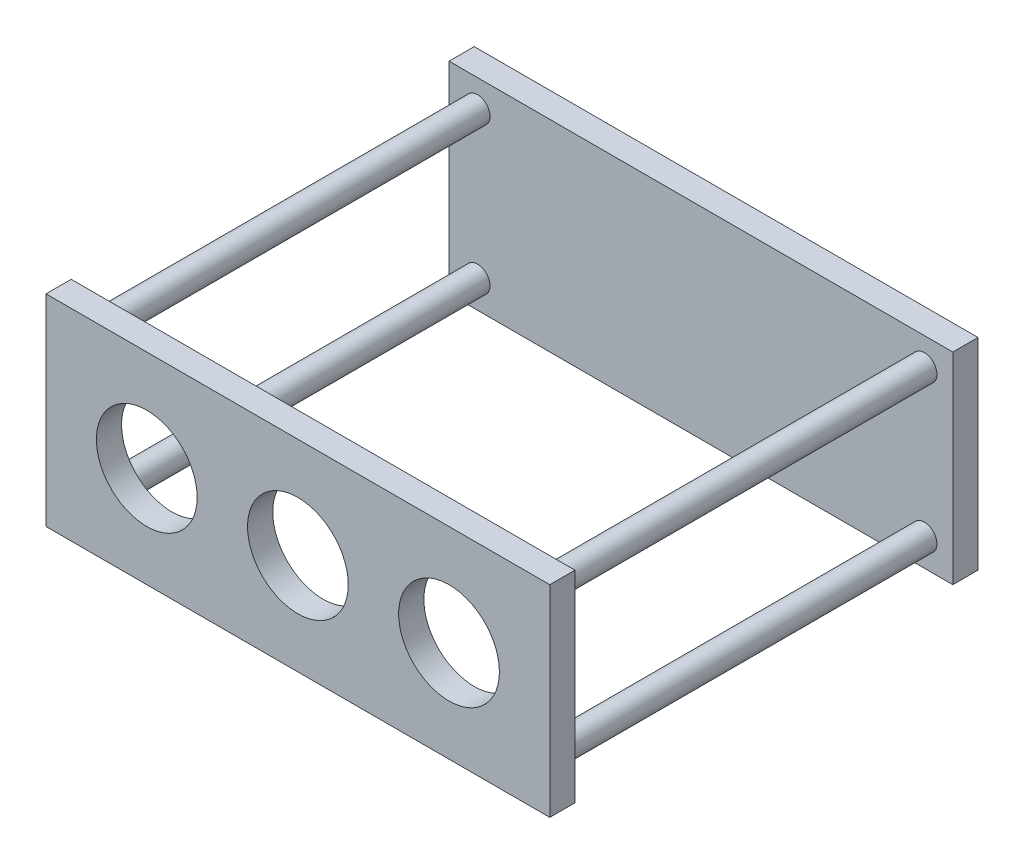
ISO-10303-21;
HEADER;
FILE_DESCRIPTION(('STEP AP214'),'2;1');
FILE_NAME('part.step','',(''),(''),'','','');
FILE_SCHEMA(('AUTOMOTIVE_DESIGN { 1 0 10303 214 1 1 1 1 }'));
ENDSEC;
DATA;
#1=APPLICATION_CONTEXT('core data for automotive mechanical design processes');
#2=APPLICATION_PROTOCOL_DEFINITION('international standard','automotive_design',2000,#1);
#3=PRODUCT_CONTEXT('',#1,'mechanical');
#4=PRODUCT('Part','Part','',(#3));
#5=PRODUCT_RELATED_PRODUCT_CATEGORY('part','',(#4));
#6=PRODUCT_DEFINITION_FORMATION('','',#4);
#7=PRODUCT_DEFINITION_CONTEXT('part definition',#1,'design');
#8=PRODUCT_DEFINITION('design','',#6,#7);
#9=PRODUCT_DEFINITION_SHAPE('','',#8);
#10=(LENGTH_UNIT() NAMED_UNIT(*) SI_UNIT(.MILLI.,.METRE.));
#11=(NAMED_UNIT(*) PLANE_ANGLE_UNIT() SI_UNIT($,.RADIAN.));
#12=(NAMED_UNIT(*) SI_UNIT($,.STERADIAN.) SOLID_ANGLE_UNIT());
#13=UNCERTAINTY_MEASURE_WITH_UNIT(LENGTH_MEASURE(1.E-05),#10,'distance_accuracy_value','');
#14=(GEOMETRIC_REPRESENTATION_CONTEXT(3) GLOBAL_UNCERTAINTY_ASSIGNED_CONTEXT((#13)) GLOBAL_UNIT_ASSIGNED_CONTEXT((#10,
#11,#12)) REPRESENTATION_CONTEXT('',''));
#15=CARTESIAN_POINT('',(0.,0.,0.));
#16=DIRECTION('',(0.,0.,1.));
#17=DIRECTION('',(1.,0.,0.));
#18=AXIS2_PLACEMENT_3D('',#15,#16,#17);
#19=CARTESIAN_POINT('',(100.,40.,10.));
#20=DIRECTION('',(-1.,0.,0.));
#21=DIRECTION('',(0.,0.,1.));
#22=AXIS2_PLACEMENT_3D('',#19,#20,#21);
#23=PLANE('',#22);
#24=DIRECTION('',(0.,1.,0.));
#25=VECTOR('',#24,1.);
#26=CARTESIAN_POINT('',(100.,40.,0.));
#27=LINE('',#26,#25);
#28=CARTESIAN_POINT('',(100.,-40.,0.));
#29=VERTEX_POINT('',#28);
#30=CARTESIAN_POINT('',(100.,40.,0.));
#31=VERTEX_POINT('',#30);
#32=EDGE_CURVE('E180',#29,#31,#27,.T.);
#33=ORIENTED_EDGE('',*,*,#32,.T.);
#34=DIRECTION('',(0.,0.,-1.));
#35=VECTOR('',#34,1.);
#36=CARTESIAN_POINT('',(100.,40.,10.));
#37=LINE('',#36,#35);
#38=CARTESIAN_POINT('',(100.,40.,10.));
#39=VERTEX_POINT('',#38);
#40=EDGE_CURVE('E11',#39,#31,#37,.T.);
#41=ORIENTED_EDGE('',*,*,#40,.F.);
#42=DIRECTION('',(0.,1.,0.));
#43=VECTOR('',#42,1.);
#44=CARTESIAN_POINT('',(100.,40.,10.));
#45=LINE('',#44,#43);
#46=CARTESIAN_POINT('',(100.,-40.,10.));
#47=VERTEX_POINT('',#46);
#48=EDGE_CURVE('E181',#47,#39,#45,.T.);
#49=ORIENTED_EDGE('',*,*,#48,.F.);
#50=DIRECTION('',(0.,0.,-1.));
#51=VECTOR('',#50,1.);
#52=CARTESIAN_POINT('',(100.,-40.,10.));
#53=LINE('',#52,#51);
#54=EDGE_CURVE('E191',#47,#29,#53,.T.);
#55=ORIENTED_EDGE('',*,*,#54,.T.);
#56=EDGE_LOOP('',(#33,#41,#49,#55));
#57=FACE_BOUND('',#56,.T.);
#58=ADVANCED_FACE('F39',(#57),#23,.F.);
#59=CARTESIAN_POINT('',(-100.,40.,10.));
#60=DIRECTION('',(0.,-1.,0.));
#61=DIRECTION('',(0.,0.,-1.));
#62=AXIS2_PLACEMENT_3D('',#59,#60,#61);
#63=PLANE('',#62);
#64=DIRECTION('',(-1.,0.,0.));
#65=VECTOR('',#64,1.);
#66=CARTESIAN_POINT('',(-100.,40.,0.));
#67=LINE('',#66,#65);
#68=CARTESIAN_POINT('',(-100.,40.,0.));
#69=VERTEX_POINT('',#68);
#70=EDGE_CURVE('E195',#31,#69,#67,.T.);
#71=ORIENTED_EDGE('',*,*,#70,.T.);
#72=DIRECTION('',(0.,0.,-1.));
#73=VECTOR('',#72,1.);
#74=CARTESIAN_POINT('',(-100.,40.,10.));
#75=LINE('',#74,#73);
#76=CARTESIAN_POINT('',(-100.,40.,10.));
#77=VERTEX_POINT('',#76);
#78=EDGE_CURVE('E48',#77,#69,#75,.T.);
#79=ORIENTED_EDGE('',*,*,#78,.F.);
#80=DIRECTION('',(-1.,0.,0.));
#81=VECTOR('',#80,1.);
#82=CARTESIAN_POINT('',(-100.,40.,10.));
#83=LINE('',#82,#81);
#84=EDGE_CURVE('E87',#39,#77,#83,.T.);
#85=ORIENTED_EDGE('',*,*,#84,.F.);
#86=ORIENTED_EDGE('',*,*,#40,.T.);
#87=EDGE_LOOP('',(#71,#79,#85,#86));
#88=FACE_BOUND('',#87,.T.);
#89=ADVANCED_FACE('F225',(#88),#63,.F.);
#90=CARTESIAN_POINT('',(-100.,40.,10.));
#91=DIRECTION('',(1.,0.,0.));
#92=DIRECTION('',(0.,0.,-1.));
#93=AXIS2_PLACEMENT_3D('',#90,#91,#92);
#94=PLANE('',#93);
#95=DIRECTION('',(0.,-1.,0.));
#96=VECTOR('',#95,1.);
#97=CARTESIAN_POINT('',(-100.,40.,0.));
#98=LINE('',#97,#96);
#99=CARTESIAN_POINT('',(-100.,-40.,0.));
#100=VERTEX_POINT('',#99);
#101=EDGE_CURVE('E74',#69,#100,#98,.T.);
#102=ORIENTED_EDGE('',*,*,#101,.T.);
#103=DIRECTION('',(0.,0.,-1.));
#104=VECTOR('',#103,1.);
#105=CARTESIAN_POINT('',(-100.,-40.,10.));
#106=LINE('',#105,#104);
#107=CARTESIAN_POINT('',(-100.,-40.,10.));
#108=VERTEX_POINT('',#107);
#109=EDGE_CURVE('E204',#108,#100,#106,.T.);
#110=ORIENTED_EDGE('',*,*,#109,.F.);
#111=DIRECTION('',(0.,-1.,0.));
#112=VECTOR('',#111,1.);
#113=CARTESIAN_POINT('',(-100.,40.,10.));
#114=LINE('',#113,#112);
#115=EDGE_CURVE('E186',#77,#108,#114,.T.);
#116=ORIENTED_EDGE('',*,*,#115,.F.);
#117=ORIENTED_EDGE('',*,*,#78,.T.);
#118=EDGE_LOOP('',(#102,#110,#116,#117));
#119=FACE_BOUND('',#118,.T.);
#120=ADVANCED_FACE('F208',(#119),#94,.F.);
#121=CARTESIAN_POINT('',(-100.,-40.,10.));
#122=DIRECTION('',(0.,1.,0.));
#123=DIRECTION('',(0.,0.,1.));
#124=AXIS2_PLACEMENT_3D('',#121,#122,#123);
#125=PLANE('',#124);
#126=DIRECTION('',(1.,0.,0.));
#127=VECTOR('',#126,1.);
#128=CARTESIAN_POINT('',(-100.,-40.,0.));
#129=LINE('',#128,#127);
#130=EDGE_CURVE('E80',#100,#29,#129,.T.);
#131=ORIENTED_EDGE('',*,*,#130,.T.);
#132=ORIENTED_EDGE('',*,*,#54,.F.);
#133=DIRECTION('',(1.,0.,0.));
#134=VECTOR('',#133,1.);
#135=CARTESIAN_POINT('',(-100.,-40.,10.));
#136=LINE('',#135,#134);
#137=EDGE_CURVE('E56',#108,#47,#136,.T.);
#138=ORIENTED_EDGE('',*,*,#137,.F.);
#139=ORIENTED_EDGE('',*,*,#109,.T.);
#140=EDGE_LOOP('',(#131,#132,#138,#139));
#141=FACE_BOUND('',#140,.T.);
#142=ADVANCED_FACE('F215',(#141),#125,.F.);
#143=CARTESIAN_POINT('',(0.,0.,10.));
#144=DIRECTION('',(0.,0.,1.));
#145=DIRECTION('',(1.,0.,0.));
#146=AXIS2_PLACEMENT_3D('',#143,#144,#145);
#147=PLANE('',#146);
#148=CARTESIAN_POINT('',(-88.7081756139357,-29.1319748317954,10.));
#149=DIRECTION('',(0.,0.,1.));
#150=DIRECTION('',(1.,0.,0.));
#151=AXIS2_PLACEMENT_3D('',#148,#149,#150);
#152=CIRCLE('',#151,5.);
#153=CARTESIAN_POINT('',(-83.7081756139357,-29.1319748317954,10.));
#154=VERTEX_POINT('',#153);
#155=EDGE_CURVE('E147',#154,#154,#152,.F.);
#156=ORIENTED_EDGE('',*,*,#155,.T.);
#157=EDGE_LOOP('',(#156));
#158=FACE_BOUND('',#157,.T.);
#159=CARTESIAN_POINT('',(88.7081756139357,-29.1319748317954,10.));
#160=DIRECTION('',(0.,0.,1.));
#161=DIRECTION('',(1.,0.,0.));
#162=AXIS2_PLACEMENT_3D('',#159,#160,#161);
#163=CIRCLE('',#162,5.);
#164=CARTESIAN_POINT('',(93.7081756139357,-29.1319748317954,10.));
#165=VERTEX_POINT('',#164);
#166=EDGE_CURVE('E160',#165,#165,#163,.F.);
#167=ORIENTED_EDGE('',*,*,#166,.T.);
#168=EDGE_LOOP('',(#167));
#169=FACE_BOUND('',#168,.T.);
#170=CARTESIAN_POINT('',(88.7081756139357,29.1319748317954,10.));
#171=DIRECTION('',(0.,0.,1.));
#172=DIRECTION('',(1.,0.,0.));
#173=AXIS2_PLACEMENT_3D('',#170,#171,#172);
#174=CIRCLE('',#173,5.);
#175=CARTESIAN_POINT('',(93.7081756139357,29.1319748317954,10.));
#176=VERTEX_POINT('',#175);
#177=EDGE_CURVE('E168',#176,#176,#174,.F.);
#178=ORIENTED_EDGE('',*,*,#177,.T.);
#179=EDGE_LOOP('',(#178));
#180=FACE_BOUND('',#179,.T.);
#181=CARTESIAN_POINT('',(-88.7081756139357,29.1319748317954,10.));
#182=DIRECTION('',(0.,0.,1.));
#183=DIRECTION('',(1.,0.,0.));
#184=AXIS2_PLACEMENT_3D('',#181,#182,#183);
#185=CIRCLE('',#184,5.);
#186=CARTESIAN_POINT('',(-83.7081756139357,29.1319748317954,10.));
#187=VERTEX_POINT('',#186);
#188=EDGE_CURVE('E176',#187,#187,#185,.F.);
#189=ORIENTED_EDGE('',*,*,#188,.T.);
#190=EDGE_LOOP('',(#189));
#191=FACE_BOUND('',#190,.T.);
#192=ORIENTED_EDGE('',*,*,#48,.T.);
#193=ORIENTED_EDGE('',*,*,#84,.T.);
#194=ORIENTED_EDGE('',*,*,#115,.T.);
#195=ORIENTED_EDGE('',*,*,#137,.T.);
#196=EDGE_LOOP('',(#192,#193,#194,#195));
#197=FACE_BOUND('',#196,.T.);
#198=ADVANCED_FACE('F217',(#158,#169,#180,#191,#197),#147,.T.);
#199=CARTESIAN_POINT('',(0.,0.,0.));
#200=DIRECTION('',(0.,0.,1.));
#201=DIRECTION('',(1.,0.,0.));
#202=AXIS2_PLACEMENT_3D('',#199,#200,#201);
#203=PLANE('',#202);
#204=ORIENTED_EDGE('',*,*,#32,.F.);
#205=ORIENTED_EDGE('',*,*,#130,.F.);
#206=ORIENTED_EDGE('',*,*,#101,.F.);
#207=ORIENTED_EDGE('',*,*,#70,.F.);
#208=EDGE_LOOP('',(#204,#205,#206,#207));
#209=FACE_BOUND('',#208,.T.);
#210=ADVANCED_FACE('F211',(#209),#203,.F.);
#211=CARTESIAN_POINT('',(-88.7081756139357,29.1319748317954,160.));
#212=DIRECTION('',(0.,0.,-1.));
#213=DIRECTION('',(-1.,0.,0.));
#214=AXIS2_PLACEMENT_3D('',#211,#212,#213);
#215=CYLINDRICAL_SURFACE('',#214,5.);
#216=ORIENTED_EDGE('',*,*,#188,.F.);
#217=EDGE_LOOP('',(#216));
#218=FACE_BOUND('',#217,.T.);
#219=CARTESIAN_POINT('',(-88.7081756139357,29.1319748317954,160.));
#220=DIRECTION('',(0.,0.,1.));
#221=DIRECTION('',(1.,0.,0.));
#222=AXIS2_PLACEMENT_3D('',#219,#220,#221);
#223=CIRCLE('',#222,5.);
#224=CARTESIAN_POINT('',(-83.7081756139357,29.1319748317954,160.));
#225=VERTEX_POINT('',#224);
#226=EDGE_CURVE('E172',#225,#225,#223,.T.);
#227=ORIENTED_EDGE('',*,*,#226,.F.);
#228=EDGE_LOOP('',(#227));
#229=FACE_BOUND('',#228,.T.);
#230=ADVANCED_FACE('F257',(#218,#229),#215,.T.);
#231=CARTESIAN_POINT('',(88.7081756139357,29.1319748317954,160.));
#232=DIRECTION('',(0.,0.,-1.));
#233=DIRECTION('',(-1.,0.,0.));
#234=AXIS2_PLACEMENT_3D('',#231,#232,#233);
#235=CYLINDRICAL_SURFACE('',#234,5.);
#236=ORIENTED_EDGE('',*,*,#177,.F.);
#237=EDGE_LOOP('',(#236));
#238=FACE_BOUND('',#237,.T.);
#239=CARTESIAN_POINT('',(88.7081756139357,29.1319748317954,160.));
#240=DIRECTION('',(0.,0.,1.));
#241=DIRECTION('',(-1.,0.,0.));
#242=AXIS2_PLACEMENT_3D('',#239,#240,#241);
#243=CIRCLE('',#242,5.);
#244=CARTESIAN_POINT('',(83.7081756139357,29.1319748317954,160.));
#245=VERTEX_POINT('',#244);
#246=EDGE_CURVE('E164',#245,#245,#243,.T.);
#247=ORIENTED_EDGE('',*,*,#246,.F.);
#248=EDGE_LOOP('',(#247));
#249=FACE_BOUND('',#248,.T.);
#250=ADVANCED_FACE('F265',(#238,#249),#235,.T.);
#251=CARTESIAN_POINT('',(88.7081756139357,-29.1319748317954,160.));
#252=DIRECTION('',(0.,0.,-1.));
#253=DIRECTION('',(-1.,0.,0.));
#254=AXIS2_PLACEMENT_3D('',#251,#252,#253);
#255=CYLINDRICAL_SURFACE('',#254,5.);
#256=ORIENTED_EDGE('',*,*,#166,.F.);
#257=EDGE_LOOP('',(#256));
#258=FACE_BOUND('',#257,.T.);
#259=CARTESIAN_POINT('',(88.7081756139357,-29.1319748317954,160.));
#260=DIRECTION('',(0.,0.,1.));
#261=DIRECTION('',(1.,0.,0.));
#262=AXIS2_PLACEMENT_3D('',#259,#260,#261);
#263=CIRCLE('',#262,5.);
#264=CARTESIAN_POINT('',(93.7081756139357,-29.1319748317954,160.));
#265=VERTEX_POINT('',#264);
#266=EDGE_CURVE('E156',#265,#265,#263,.T.);
#267=ORIENTED_EDGE('',*,*,#266,.F.);
#268=EDGE_LOOP('',(#267));
#269=FACE_BOUND('',#268,.T.);
#270=ADVANCED_FACE('F275',(#258,#269),#255,.T.);
#271=CARTESIAN_POINT('',(-88.7081756139357,-29.1319748317954,160.));
#272=DIRECTION('',(0.,0.,-1.));
#273=DIRECTION('',(-1.,0.,0.));
#274=AXIS2_PLACEMENT_3D('',#271,#272,#273);
#275=CYLINDRICAL_SURFACE('',#274,5.);
#276=ORIENTED_EDGE('',*,*,#155,.F.);
#277=EDGE_LOOP('',(#276));
#278=FACE_BOUND('',#277,.T.);
#279=CARTESIAN_POINT('',(-88.7081756139357,-29.1319748317954,160.));
#280=DIRECTION('',(0.,0.,1.));
#281=DIRECTION('',(-1.,0.,0.));
#282=AXIS2_PLACEMENT_3D('',#279,#280,#281);
#283=CIRCLE('',#282,5.);
#284=CARTESIAN_POINT('',(-93.7081756139357,-29.1319748317954,160.));
#285=VERTEX_POINT('',#284);
#286=EDGE_CURVE('E142',#285,#285,#283,.T.);
#287=ORIENTED_EDGE('',*,*,#286,.F.);
#288=EDGE_LOOP('',(#287));
#289=FACE_BOUND('',#288,.T.);
#290=ADVANCED_FACE('F285',(#278,#289),#275,.T.);
#291=CARTESIAN_POINT('',(-100.,40.,170.));
#292=DIRECTION('',(1.,0.,0.));
#293=DIRECTION('',(0.,0.,-1.));
#294=AXIS2_PLACEMENT_3D('',#291,#292,#293);
#295=PLANE('',#294);
#296=DIRECTION('',(0.,-1.,0.));
#297=VECTOR('',#296,1.);
#298=CARTESIAN_POINT('',(-100.,40.,160.));
#299=LINE('',#298,#297);
#300=CARTESIAN_POINT('',(-100.,40.,160.));
#301=VERTEX_POINT('',#300);
#302=CARTESIAN_POINT('',(-100.,-40.,160.));
#303=VERTEX_POINT('',#302);
#304=EDGE_CURVE('E140',#301,#303,#299,.T.);
#305=ORIENTED_EDGE('',*,*,#304,.T.);
#306=DIRECTION('',(0.,0.,-1.));
#307=VECTOR('',#306,1.);
#308=CARTESIAN_POINT('',(-100.,-40.,170.));
#309=LINE('',#308,#307);
#310=CARTESIAN_POINT('',(-100.,-40.,170.));
#311=VERTEX_POINT('',#310);
#312=EDGE_CURVE('E118',#311,#303,#309,.T.);
#313=ORIENTED_EDGE('',*,*,#312,.F.);
#314=DIRECTION('',(0.,-1.,0.));
#315=VECTOR('',#314,1.);
#316=CARTESIAN_POINT('',(-100.,40.,170.));
#317=LINE('',#316,#315);
#318=CARTESIAN_POINT('',(-100.,40.,170.));
#319=VERTEX_POINT('',#318);
#320=EDGE_CURVE('E126',#319,#311,#317,.T.);
#321=ORIENTED_EDGE('',*,*,#320,.F.);
#322=DIRECTION('',(0.,0.,-1.));
#323=VECTOR('',#322,1.);
#324=CARTESIAN_POINT('',(-100.,40.,170.));
#325=LINE('',#324,#323);
#326=EDGE_CURVE('E416',#319,#301,#325,.T.);
#327=ORIENTED_EDGE('',*,*,#326,.T.);
#328=EDGE_LOOP('',(#305,#313,#321,#327));
#329=FACE_BOUND('',#328,.T.);
#330=ADVANCED_FACE('F138',(#329),#295,.F.);
#331=CARTESIAN_POINT('',(-100.,-40.,170.));
#332=DIRECTION('',(0.,1.,0.));
#333=DIRECTION('',(0.,0.,1.));
#334=AXIS2_PLACEMENT_3D('',#331,#332,#333);
#335=PLANE('',#334);
#336=DIRECTION('',(1.,0.,0.));
#337=VECTOR('',#336,1.);
#338=CARTESIAN_POINT('',(-100.,-40.,160.));
#339=LINE('',#338,#337);
#340=CARTESIAN_POINT('',(100.,-40.,160.));
#341=VERTEX_POINT('',#340);
#342=EDGE_CURVE('E419',#303,#341,#339,.T.);
#343=ORIENTED_EDGE('',*,*,#342,.T.);
#344=DIRECTION('',(0.,0.,-1.));
#345=VECTOR('',#344,1.);
#346=CARTESIAN_POINT('',(100.,-40.,170.));
#347=LINE('',#346,#345);
#348=CARTESIAN_POINT('',(100.,-40.,170.));
#349=VERTEX_POINT('',#348);
#350=EDGE_CURVE('E121',#349,#341,#347,.T.);
#351=ORIENTED_EDGE('',*,*,#350,.F.);
#352=DIRECTION('',(1.,0.,0.));
#353=VECTOR('',#352,1.);
#354=CARTESIAN_POINT('',(-100.,-40.,170.));
#355=LINE('',#354,#353);
#356=EDGE_CURVE('E114',#311,#349,#355,.T.);
#357=ORIENTED_EDGE('',*,*,#356,.F.);
#358=ORIENTED_EDGE('',*,*,#312,.T.);
#359=EDGE_LOOP('',(#343,#351,#357,#358));
#360=FACE_BOUND('',#359,.T.);
#361=ADVANCED_FACE('F116',(#360),#335,.F.);
#362=CARTESIAN_POINT('',(100.,40.,170.));
#363=DIRECTION('',(-1.,0.,0.));
#364=DIRECTION('',(0.,0.,1.));
#365=AXIS2_PLACEMENT_3D('',#362,#363,#364);
#366=PLANE('',#365);
#367=DIRECTION('',(0.,1.,0.));
#368=VECTOR('',#367,1.);
#369=CARTESIAN_POINT('',(100.,40.,160.));
#370=LINE('',#369,#368);
#371=CARTESIAN_POINT('',(100.,40.,160.));
#372=VERTEX_POINT('',#371);
#373=EDGE_CURVE('E422',#341,#372,#370,.T.);
#374=ORIENTED_EDGE('',*,*,#373,.T.);
#375=DIRECTION('',(0.,0.,-1.));
#376=VECTOR('',#375,1.);
#377=CARTESIAN_POINT('',(100.,40.,170.));
#378=LINE('',#377,#376);
#379=CARTESIAN_POINT('',(100.,40.,170.));
#380=VERTEX_POINT('',#379);
#381=EDGE_CURVE('E149',#380,#372,#378,.T.);
#382=ORIENTED_EDGE('',*,*,#381,.F.);
#383=DIRECTION('',(0.,1.,0.));
#384=VECTOR('',#383,1.);
#385=CARTESIAN_POINT('',(100.,40.,170.));
#386=LINE('',#385,#384);
#387=EDGE_CURVE('E125',#349,#380,#386,.T.);
#388=ORIENTED_EDGE('',*,*,#387,.F.);
#389=ORIENTED_EDGE('',*,*,#350,.T.);
#390=EDGE_LOOP('',(#374,#382,#388,#389));
#391=FACE_BOUND('',#390,.T.);
#392=ADVANCED_FACE('F312',(#391),#366,.F.);
#393=CARTESIAN_POINT('',(-100.,40.,170.));
#394=DIRECTION('',(0.,-1.,0.));
#395=DIRECTION('',(0.,0.,-1.));
#396=AXIS2_PLACEMENT_3D('',#393,#394,#395);
#397=PLANE('',#396);
#398=DIRECTION('',(-1.,0.,0.));
#399=VECTOR('',#398,1.);
#400=CARTESIAN_POINT('',(-100.,40.,160.));
#401=LINE('',#400,#399);
#402=EDGE_CURVE('E136',#372,#301,#401,.T.);
#403=ORIENTED_EDGE('',*,*,#402,.T.);
#404=ORIENTED_EDGE('',*,*,#326,.F.);
#405=DIRECTION('',(-1.,0.,0.));
#406=VECTOR('',#405,1.);
#407=CARTESIAN_POINT('',(-100.,40.,170.));
#408=LINE('',#407,#406);
#409=EDGE_CURVE('E131',#380,#319,#408,.T.);
#410=ORIENTED_EDGE('',*,*,#409,.F.);
#411=ORIENTED_EDGE('',*,*,#381,.T.);
#412=EDGE_LOOP('',(#403,#404,#410,#411));
#413=FACE_BOUND('',#412,.T.);
#414=ADVANCED_FACE('F321',(#413),#397,.F.);
#415=CARTESIAN_POINT('',(0.,0.,170.));
#416=DIRECTION('',(0.,0.,1.));
#417=DIRECTION('',(1.,0.,0.));
#418=AXIS2_PLACEMENT_3D('',#415,#416,#417);
#419=PLANE('',#418);
#420=CARTESIAN_POINT('',(60.,0.,170.));
#421=DIRECTION('',(0.,0.,1.));
#422=DIRECTION('',(1.,0.,0.));
#423=AXIS2_PLACEMENT_3D('',#420,#421,#422);
#424=CIRCLE('',#423,20.);
#425=CARTESIAN_POINT('',(80.,0.,170.));
#426=VERTEX_POINT('',#425);
#427=EDGE_CURVE('E390',#426,#426,#424,.T.);
#428=ORIENTED_EDGE('',*,*,#427,.F.);
#429=EDGE_LOOP('',(#428));
#430=FACE_BOUND('',#429,.T.);
#431=CARTESIAN_POINT('',(0.,0.,170.));
#432=DIRECTION('',(0.,0.,1.));
#433=DIRECTION('',(1.,0.,0.));
#434=AXIS2_PLACEMENT_3D('',#431,#432,#433);
#435=CIRCLE('',#434,20.);
#436=CARTESIAN_POINT('',(20.,0.,170.));
#437=VERTEX_POINT('',#436);
#438=EDGE_CURVE('E398',#437,#437,#435,.T.);
#439=ORIENTED_EDGE('',*,*,#438,.F.);
#440=EDGE_LOOP('',(#439));
#441=FACE_BOUND('',#440,.T.);
#442=CARTESIAN_POINT('',(-60.,0.,170.));
#443=DIRECTION('',(0.,0.,1.));
#444=DIRECTION('',(1.,0.,0.));
#445=AXIS2_PLACEMENT_3D('',#442,#443,#444);
#446=CIRCLE('',#445,20.);
#447=CARTESIAN_POINT('',(-40.,0.,170.));
#448=VERTEX_POINT('',#447);
#449=EDGE_CURVE('E408',#448,#448,#446,.T.);
#450=ORIENTED_EDGE('',*,*,#449,.F.);
#451=EDGE_LOOP('',(#450));
#452=FACE_BOUND('',#451,.T.);
#453=ORIENTED_EDGE('',*,*,#320,.T.);
#454=ORIENTED_EDGE('',*,*,#356,.T.);
#455=ORIENTED_EDGE('',*,*,#387,.T.);
#456=ORIENTED_EDGE('',*,*,#409,.T.);
#457=EDGE_LOOP('',(#453,#454,#455,#456));
#458=FACE_BOUND('',#457,.T.);
#459=ADVANCED_FACE('F129',(#430,#441,#452,#458),#419,.T.);
#460=CARTESIAN_POINT('',(0.,0.,160.));
#461=DIRECTION('',(0.,0.,1.));
#462=DIRECTION('',(1.,0.,0.));
#463=AXIS2_PLACEMENT_3D('',#460,#461,#462);
#464=PLANE('',#463);
#465=CARTESIAN_POINT('',(60.,0.,160.));
#466=DIRECTION('',(0.,0.,1.));
#467=DIRECTION('',(1.,0.,0.));
#468=AXIS2_PLACEMENT_3D('',#465,#466,#467);
#469=CIRCLE('',#468,20.);
#470=CARTESIAN_POINT('',(80.,0.,160.));
#471=VERTEX_POINT('',#470);
#472=EDGE_CURVE('E387',#471,#471,#469,.T.);
#473=ORIENTED_EDGE('',*,*,#472,.T.);
#474=EDGE_LOOP('',(#473));
#475=FACE_BOUND('',#474,.T.);
#476=CARTESIAN_POINT('',(0.,0.,160.));
#477=DIRECTION('',(0.,0.,1.));
#478=DIRECTION('',(1.,0.,0.));
#479=AXIS2_PLACEMENT_3D('',#476,#477,#478);
#480=CIRCLE('',#479,20.);
#481=CARTESIAN_POINT('',(20.,0.,160.));
#482=VERTEX_POINT('',#481);
#483=EDGE_CURVE('E392',#482,#482,#480,.T.);
#484=ORIENTED_EDGE('',*,*,#483,.T.);
#485=EDGE_LOOP('',(#484));
#486=FACE_BOUND('',#485,.T.);
#487=CARTESIAN_POINT('',(-60.,0.,160.));
#488=DIRECTION('',(0.,0.,1.));
#489=DIRECTION('',(1.,0.,0.));
#490=AXIS2_PLACEMENT_3D('',#487,#488,#489);
#491=CIRCLE('',#490,20.);
#492=CARTESIAN_POINT('',(-40.,0.,160.));
#493=VERTEX_POINT('',#492);
#494=EDGE_CURVE('E404',#493,#493,#491,.T.);
#495=ORIENTED_EDGE('',*,*,#494,.T.);
#496=EDGE_LOOP('',(#495));
#497=FACE_BOUND('',#496,.T.);
#498=ORIENTED_EDGE('',*,*,#226,.T.);
#499=EDGE_LOOP('',(#498));
#500=FACE_BOUND('',#499,.T.);
#501=ORIENTED_EDGE('',*,*,#246,.T.);
#502=EDGE_LOOP('',(#501));
#503=FACE_BOUND('',#502,.T.);
#504=ORIENTED_EDGE('',*,*,#266,.T.);
#505=EDGE_LOOP('',(#504));
#506=FACE_BOUND('',#505,.T.);
#507=ORIENTED_EDGE('',*,*,#286,.T.);
#508=EDGE_LOOP('',(#507));
#509=FACE_BOUND('',#508,.T.);
#510=ORIENTED_EDGE('',*,*,#304,.F.);
#511=ORIENTED_EDGE('',*,*,#402,.F.);
#512=ORIENTED_EDGE('',*,*,#373,.F.);
#513=ORIENTED_EDGE('',*,*,#342,.F.);
#514=EDGE_LOOP('',(#510,#511,#512,#513));
#515=FACE_BOUND('',#514,.T.);
#516=ADVANCED_FACE('F340',(#475,#486,#497,#500,#503,#506,#509,#515),#464,.F.);
#517=CARTESIAN_POINT('',(-60.,0.,160.));
#518=DIRECTION('',(0.,0.,1.));
#519=DIRECTION('',(1.,0.,0.));
#520=AXIS2_PLACEMENT_3D('',#517,#518,#519);
#521=CYLINDRICAL_SURFACE('',#520,20.);
#522=ORIENTED_EDGE('',*,*,#494,.F.);
#523=EDGE_LOOP('',(#522));
#524=FACE_BOUND('',#523,.T.);
#525=ORIENTED_EDGE('',*,*,#449,.T.);
#526=EDGE_LOOP('',(#525));
#527=FACE_BOUND('',#526,.T.);
#528=ADVANCED_FACE('F350',(#524,#527),#521,.F.);
#529=CARTESIAN_POINT('',(0.,0.,160.));
#530=DIRECTION('',(0.,0.,1.));
#531=DIRECTION('',(1.,0.,0.));
#532=AXIS2_PLACEMENT_3D('',#529,#530,#531);
#533=CYLINDRICAL_SURFACE('',#532,20.);
#534=ORIENTED_EDGE('',*,*,#483,.F.);
#535=EDGE_LOOP('',(#534));
#536=FACE_BOUND('',#535,.T.);
#537=ORIENTED_EDGE('',*,*,#438,.T.);
#538=EDGE_LOOP('',(#537));
#539=FACE_BOUND('',#538,.T.);
#540=ADVANCED_FACE('F360',(#536,#539),#533,.F.);
#541=CARTESIAN_POINT('',(60.,0.,160.));
#542=DIRECTION('',(0.,0.,1.));
#543=DIRECTION('',(1.,0.,0.));
#544=AXIS2_PLACEMENT_3D('',#541,#542,#543);
#545=CYLINDRICAL_SURFACE('',#544,20.);
#546=ORIENTED_EDGE('',*,*,#472,.F.);
#547=EDGE_LOOP('',(#546));
#548=FACE_BOUND('',#547,.T.);
#549=ORIENTED_EDGE('',*,*,#427,.T.);
#550=EDGE_LOOP('',(#549));
#551=FACE_BOUND('',#550,.T.);
#552=ADVANCED_FACE('F370',(#548,#551),#545,.F.);
#553=CLOSED_SHELL('',(#58,#89,#120,#142,#198,#210,#230,#250,#270,#290,#330,#361,#392,#414,#459,
#516,#528,#540,#552));
#554=MANIFOLD_SOLID_BREP('B2',#553);
#555=ADVANCED_BREP_SHAPE_REPRESENTATION('',(#18,#554),#14);
#556=SHAPE_DEFINITION_REPRESENTATION(#9,#555);
ENDSEC;
END-ISO-10303-21;
